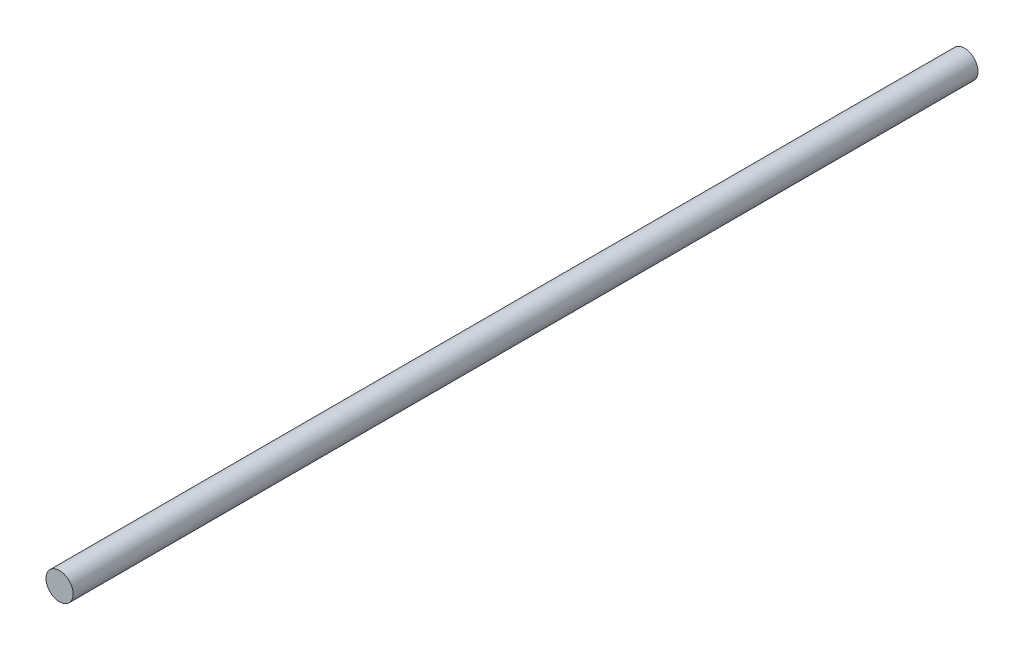
ISO-10303-21;
HEADER;
FILE_DESCRIPTION(('STEP AP214'),'2;1');
FILE_NAME('part.step','',(''),(''),'','','');
FILE_SCHEMA(('AUTOMOTIVE_DESIGN { 1 0 10303 214 1 1 1 1 }'));
ENDSEC;
DATA;
#1=APPLICATION_CONTEXT('core data for automotive mechanical design processes');
#2=APPLICATION_PROTOCOL_DEFINITION('international standard','automotive_design',2000,#1);
#3=PRODUCT_CONTEXT('',#1,'mechanical');
#4=PRODUCT('Part','Part','',(#3));
#5=PRODUCT_RELATED_PRODUCT_CATEGORY('part','',(#4));
#6=PRODUCT_DEFINITION_FORMATION('','',#4);
#7=PRODUCT_DEFINITION_CONTEXT('part definition',#1,'design');
#8=PRODUCT_DEFINITION('design','',#6,#7);
#9=PRODUCT_DEFINITION_SHAPE('','',#8);
#10=(LENGTH_UNIT() NAMED_UNIT(*) SI_UNIT(.MILLI.,.METRE.));
#11=(NAMED_UNIT(*) PLANE_ANGLE_UNIT() SI_UNIT($,.RADIAN.));
#12=(NAMED_UNIT(*) SI_UNIT($,.STERADIAN.) SOLID_ANGLE_UNIT());
#13=UNCERTAINTY_MEASURE_WITH_UNIT(LENGTH_MEASURE(1.E-05),#10,'distance_accuracy_value','');
#14=(GEOMETRIC_REPRESENTATION_CONTEXT(3) GLOBAL_UNCERTAINTY_ASSIGNED_CONTEXT((#13)) GLOBAL_UNIT_ASSIGNED_CONTEXT((#10,
#11,#12)) REPRESENTATION_CONTEXT('',''));
#15=CARTESIAN_POINT('',(0.,0.,0.));
#16=DIRECTION('',(0.,0.,1.));
#17=DIRECTION('',(1.,0.,0.));
#18=AXIS2_PLACEMENT_3D('',#15,#16,#17);
#19=CARTESIAN_POINT('',(0.,0.,100.));
#20=DIRECTION('',(0.,0.,-1.));
#21=DIRECTION('',(-1.,0.,0.));
#22=AXIS2_PLACEMENT_3D('',#19,#20,#21);
#23=CYLINDRICAL_SURFACE('',#22,1.5);
#24=CARTESIAN_POINT('',(0.,0.,100.));
#25=DIRECTION('',(0.,0.,1.));
#26=DIRECTION('',(1.,0.,0.));
#27=AXIS2_PLACEMENT_3D('',#24,#25,#26);
#28=CIRCLE('',#27,1.5);
#29=CARTESIAN_POINT('',(1.5,0.,100.));
#30=VERTEX_POINT('',#29);
#31=EDGE_CURVE('E10',#30,#30,#28,.T.);
#32=ORIENTED_EDGE('',*,*,#31,.F.);
#33=EDGE_LOOP('',(#32));
#34=FACE_BOUND('',#33,.T.);
#35=CARTESIAN_POINT('',(0.,0.,0.));
#36=DIRECTION('',(0.,0.,1.));
#37=DIRECTION('',(1.,0.,0.));
#38=AXIS2_PLACEMENT_3D('',#35,#36,#37);
#39=CIRCLE('',#38,1.5);
#40=CARTESIAN_POINT('',(1.5,0.,0.));
#41=VERTEX_POINT('',#40);
#42=EDGE_CURVE('E42',#41,#41,#39,.T.);
#43=ORIENTED_EDGE('',*,*,#42,.T.);
#44=EDGE_LOOP('',(#43));
#45=FACE_BOUND('',#44,.T.);
#46=ADVANCED_FACE('F39',(#34,#45),#23,.T.);
#47=CARTESIAN_POINT('',(0.,0.,100.));
#48=DIRECTION('',(0.,0.,1.));
#49=DIRECTION('',(1.,0.,0.));
#50=AXIS2_PLACEMENT_3D('',#47,#48,#49);
#51=PLANE('',#50);
#52=ORIENTED_EDGE('',*,*,#31,.T.);
#53=EDGE_LOOP('',(#52));
#54=FACE_BOUND('',#53,.T.);
#55=ADVANCED_FACE('F54',(#54),#51,.T.);
#56=CARTESIAN_POINT('',(0.,0.,0.));
#57=DIRECTION('',(0.,0.,1.));
#58=DIRECTION('',(1.,0.,0.));
#59=AXIS2_PLACEMENT_3D('',#56,#57,#58);
#60=PLANE('',#59);
#61=ORIENTED_EDGE('',*,*,#42,.F.);
#62=EDGE_LOOP('',(#61));
#63=FACE_BOUND('',#62,.T.);
#64=ADVANCED_FACE('F52',(#63),#60,.F.);
#65=CLOSED_SHELL('',(#46,#55,#64));
#66=MANIFOLD_SOLID_BREP('B2',#65);
#67=ADVANCED_BREP_SHAPE_REPRESENTATION('',(#18,#66),#14);
#68=SHAPE_DEFINITION_REPRESENTATION(#9,#67);
ENDSEC;
END-ISO-10303-21;
